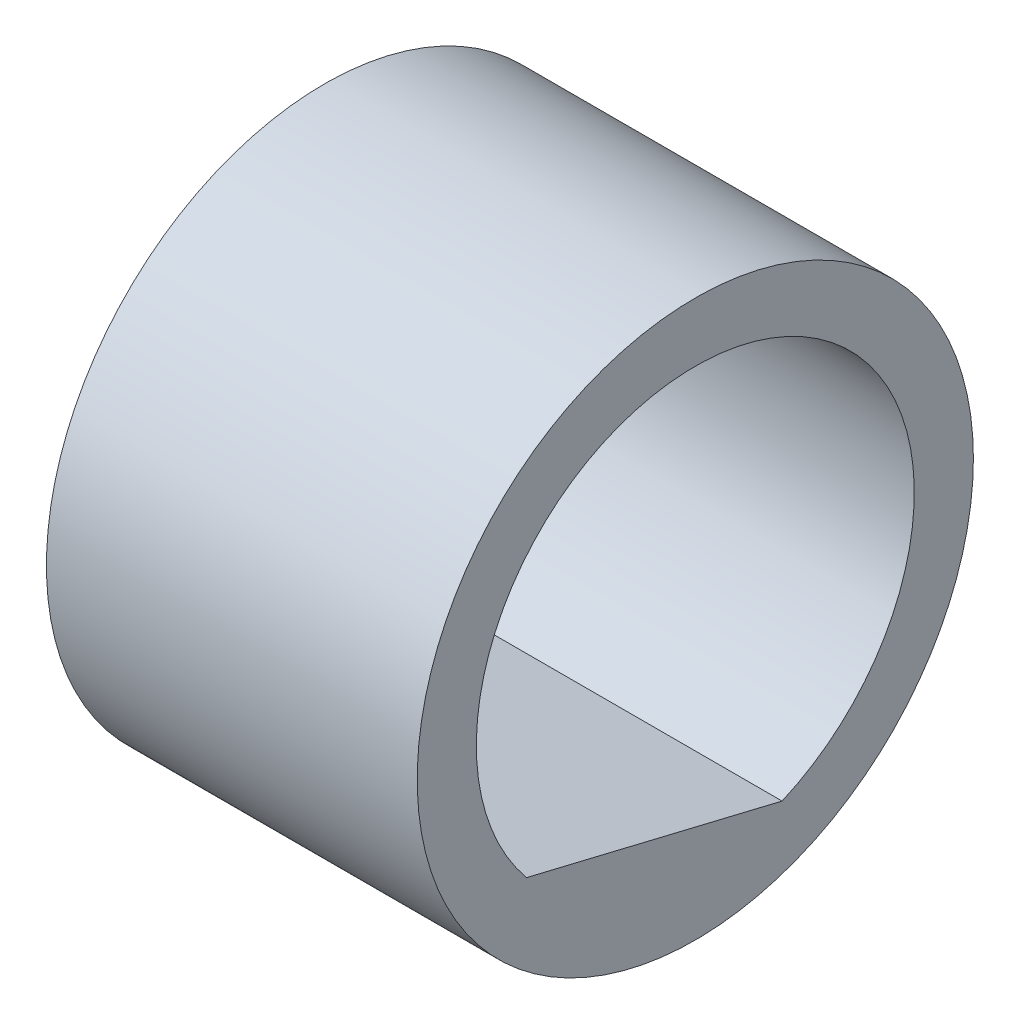
ISO-10303-21;
HEADER;
FILE_DESCRIPTION(('STEP AP214'),'2;1');
FILE_NAME('part.step','',(''),(''),'','','');
FILE_SCHEMA(('AUTOMOTIVE_DESIGN { 1 0 10303 214 1 1 1 1 }'));
ENDSEC;
DATA;
#1=APPLICATION_CONTEXT('core data for automotive mechanical design processes');
#2=APPLICATION_PROTOCOL_DEFINITION('international standard','automotive_design',2000,#1);
#3=PRODUCT_CONTEXT('',#1,'mechanical');
#4=PRODUCT('Part','Part','',(#3));
#5=PRODUCT_RELATED_PRODUCT_CATEGORY('part','',(#4));
#6=PRODUCT_DEFINITION_FORMATION('','',#4);
#7=PRODUCT_DEFINITION_CONTEXT('part definition',#1,'design');
#8=PRODUCT_DEFINITION('design','',#6,#7);
#9=PRODUCT_DEFINITION_SHAPE('','',#8);
#10=(LENGTH_UNIT() NAMED_UNIT(*) SI_UNIT(.MILLI.,.METRE.));
#11=(NAMED_UNIT(*) PLANE_ANGLE_UNIT() SI_UNIT($,.RADIAN.));
#12=(NAMED_UNIT(*) SI_UNIT($,.STERADIAN.) SOLID_ANGLE_UNIT());
#13=UNCERTAINTY_MEASURE_WITH_UNIT(LENGTH_MEASURE(1.E-05),#10,'distance_accuracy_value','');
#14=(GEOMETRIC_REPRESENTATION_CONTEXT(3) GLOBAL_UNCERTAINTY_ASSIGNED_CONTEXT((#13)) GLOBAL_UNIT_ASSIGNED_CONTEXT((#10,
#11,#12)) REPRESENTATION_CONTEXT('',''));
#15=CARTESIAN_POINT('',(0.,0.,0.));
#16=DIRECTION('',(0.,0.,1.));
#17=DIRECTION('',(1.,0.,0.));
#18=AXIS2_PLACEMENT_3D('',#15,#16,#17);
#19=CARTESIAN_POINT('',(5.08,0.,0.));
#20=DIRECTION('',(-1.,0.,0.));
#21=DIRECTION('',(0.,0.,1.));
#22=AXIS2_PLACEMENT_3D('',#19,#20,#21);
#23=CYLINDRICAL_SURFACE('',#22,3.81);
#24=CARTESIAN_POINT('',(5.08,0.,0.));
#25=DIRECTION('',(1.,0.,0.));
#26=DIRECTION('',(0.,0.,-1.));
#27=AXIS2_PLACEMENT_3D('',#24,#25,#26);
#28=CIRCLE('',#27,3.81);
#29=CARTESIAN_POINT('',(5.08,0.,-3.81));
#30=VERTEX_POINT('',#29);
#31=EDGE_CURVE('E11',#30,#30,#28,.T.);
#32=ORIENTED_EDGE('',*,*,#31,.F.);
#33=EDGE_LOOP('',(#32));
#34=FACE_BOUND('',#33,.T.);
#35=CARTESIAN_POINT('',(0.,0.,0.));
#36=DIRECTION('',(1.,0.,0.));
#37=DIRECTION('',(0.,0.,-1.));
#38=AXIS2_PLACEMENT_3D('',#35,#36,#37);
#39=CIRCLE('',#38,3.81);
#40=CARTESIAN_POINT('',(0.,0.,-3.81));
#41=VERTEX_POINT('',#40);
#42=EDGE_CURVE('E35',#41,#41,#39,.T.);
#43=ORIENTED_EDGE('',*,*,#42,.T.);
#44=EDGE_LOOP('',(#43));
#45=FACE_BOUND('',#44,.T.);
#46=ADVANCED_FACE('F32',(#34,#45),#23,.T.);
#47=CARTESIAN_POINT('',(5.08,0.,0.));
#48=DIRECTION('',(1.,0.,0.));
#49=DIRECTION('',(0.,0.,-1.));
#50=AXIS2_PLACEMENT_3D('',#47,#48,#49);
#51=PLANE('',#50);
#52=CARTESIAN_POINT('',(5.08,0.,0.));
#53=DIRECTION('',(1.,0.,0.));
#54=DIRECTION('',(0.,0.,-1.));
#55=AXIS2_PLACEMENT_3D('',#52,#53,#54);
#56=CIRCLE('',#55,3.00000000000002);
#57=CARTESIAN_POINT('',(5.08,-1.91253255406253,2.3113241290765));
#58=VERTEX_POINT('',#57);
#59=CARTESIAN_POINT('',(5.08,-2.75438027905095,-1.18886049575858));
#60=VERTEX_POINT('',#59);
#61=EDGE_CURVE('E67',#58,#60,#56,.F.);
#62=ORIENTED_EDGE('',*,*,#61,.T.);
#63=DIRECTION('',(0.,0.233846590274562,0.972273506898631));
#64=VECTOR('',#63,1.);
#65=CARTESIAN_POINT('',(5.08,-1.91253255406253,2.3113241290765));
#66=LINE('',#65,#64);
#67=EDGE_CURVE('E59',#60,#58,#66,.T.);
#68=ORIENTED_EDGE('',*,*,#67,.T.);
#69=EDGE_LOOP('',(#62,#68));
#70=FACE_BOUND('',#69,.T.);
#71=ORIENTED_EDGE('',*,*,#31,.T.);
#72=EDGE_LOOP('',(#71));
#73=FACE_BOUND('',#72,.T.);
#74=ADVANCED_FACE('F70',(#70,#73),#51,.T.);
#75=CARTESIAN_POINT('',(0.,0.,0.));
#76=DIRECTION('',(1.,0.,0.));
#77=DIRECTION('',(0.,0.,-1.));
#78=AXIS2_PLACEMENT_3D('',#75,#76,#77);
#79=PLANE('',#78);
#80=DIRECTION('',(0.,0.233846590274562,0.97227350689863));
#81=VECTOR('',#80,1.);
#82=CARTESIAN_POINT('',(0.,-1.91253255406253,2.3113241290765));
#83=LINE('',#82,#81);
#84=CARTESIAN_POINT('',(0.,-2.75438027905095,-1.18886049575858));
#85=VERTEX_POINT('',#84);
#86=CARTESIAN_POINT('',(0.,-1.91253255406253,2.3113241290765));
#87=VERTEX_POINT('',#86);
#88=EDGE_CURVE('E68',#85,#87,#83,.T.);
#89=ORIENTED_EDGE('',*,*,#88,.F.);
#90=CARTESIAN_POINT('',(0.,0.,0.));
#91=DIRECTION('',(-1.,0.,0.));
#92=DIRECTION('',(0.,0.,1.));
#93=AXIS2_PLACEMENT_3D('',#90,#91,#92);
#94=CIRCLE('',#93,3.00000000000002);
#95=EDGE_CURVE('E53',#87,#85,#94,.T.);
#96=ORIENTED_EDGE('',*,*,#95,.F.);
#97=EDGE_LOOP('',(#89,#96));
#98=FACE_BOUND('',#97,.T.);
#99=ORIENTED_EDGE('',*,*,#42,.F.);
#100=EDGE_LOOP('',(#99));
#101=FACE_BOUND('',#100,.T.);
#102=ADVANCED_FACE('F77',(#98,#101),#79,.F.);
#103=CARTESIAN_POINT('',(5.081,0.,0.));
#104=DIRECTION('',(-1.,0.,0.));
#105=DIRECTION('',(0.,0.,1.));
#106=AXIS2_PLACEMENT_3D('',#103,#104,#105);
#107=CYLINDRICAL_SURFACE('',#106,3.00000000000002);
#108=DIRECTION('',(-1.,0.,0.));
#109=VECTOR('',#108,1.);
#110=CARTESIAN_POINT('',(5.081,-1.91253255406253,2.3113241290765));
#111=LINE('',#110,#109);
#112=EDGE_CURVE('E46',#58,#87,#111,.T.);
#113=ORIENTED_EDGE('',*,*,#112,.T.);
#114=ORIENTED_EDGE('',*,*,#95,.T.);
#115=DIRECTION('',(-1.,0.,0.));
#116=VECTOR('',#115,1.);
#117=CARTESIAN_POINT('',(5.081,-2.75438027905095,-1.18886049575858));
#118=LINE('',#117,#116);
#119=EDGE_CURVE('E61',#60,#85,#118,.T.);
#120=ORIENTED_EDGE('',*,*,#119,.F.);
#121=ORIENTED_EDGE('',*,*,#61,.F.);
#122=EDGE_LOOP('',(#113,#114,#120,#121));
#123=FACE_BOUND('',#122,.T.);
#124=ADVANCED_FACE('F66',(#123),#107,.F.);
#125=CARTESIAN_POINT('',(5.081,-1.91253255406253,2.3113241290765));
#126=DIRECTION('',(0.,-0.972273506898631,0.233846590274562));
#127=DIRECTION('',(0.,-0.233846590274562,-0.972273506898631));
#128=AXIS2_PLACEMENT_3D('',#125,#126,#127);
#129=PLANE('',#128);
#130=ORIENTED_EDGE('',*,*,#119,.T.);
#131=ORIENTED_EDGE('',*,*,#88,.T.);
#132=ORIENTED_EDGE('',*,*,#112,.F.);
#133=ORIENTED_EDGE('',*,*,#67,.F.);
#134=EDGE_LOOP('',(#130,#131,#132,#133));
#135=FACE_BOUND('',#134,.T.);
#136=ADVANCED_FACE('F60',(#135),#129,.F.);
#137=CLOSED_SHELL('',(#46,#74,#102,#124,#136));
#138=MANIFOLD_SOLID_BREP('B2',#137);
#139=ADVANCED_BREP_SHAPE_REPRESENTATION('',(#18,#138),#14);
#140=SHAPE_DEFINITION_REPRESENTATION(#9,#139);
ENDSEC;
END-ISO-10303-21;
